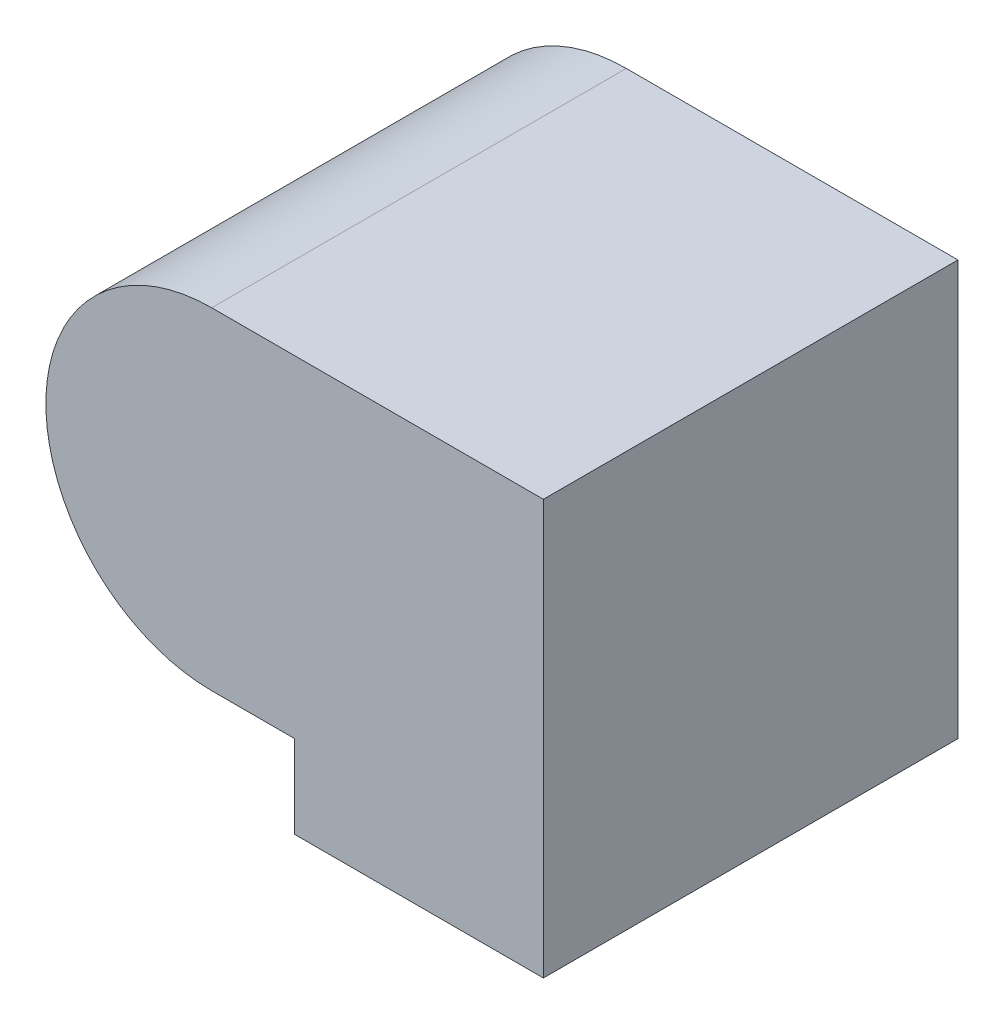
ISO-10303-21;
HEADER;
FILE_DESCRIPTION(('STEP AP214'),'2;1');
FILE_NAME('part.step','',(''),(''),'','','');
FILE_SCHEMA(('AUTOMOTIVE_DESIGN { 1 0 10303 214 1 1 1 1 }'));
ENDSEC;
DATA;
#1=APPLICATION_CONTEXT('core data for automotive mechanical design processes');
#2=APPLICATION_PROTOCOL_DEFINITION('international standard','automotive_design',2000,#1);
#3=PRODUCT_CONTEXT('',#1,'mechanical');
#4=PRODUCT('Part','Part','',(#3));
#5=PRODUCT_RELATED_PRODUCT_CATEGORY('part','',(#4));
#6=PRODUCT_DEFINITION_FORMATION('','',#4);
#7=PRODUCT_DEFINITION_CONTEXT('part definition',#1,'design');
#8=PRODUCT_DEFINITION('design','',#6,#7);
#9=PRODUCT_DEFINITION_SHAPE('','',#8);
#10=(LENGTH_UNIT() NAMED_UNIT(*) SI_UNIT(.MILLI.,.METRE.));
#11=(NAMED_UNIT(*) PLANE_ANGLE_UNIT() SI_UNIT($,.RADIAN.));
#12=(NAMED_UNIT(*) SI_UNIT($,.STERADIAN.) SOLID_ANGLE_UNIT());
#13=UNCERTAINTY_MEASURE_WITH_UNIT(LENGTH_MEASURE(1.E-05),#10,'distance_accuracy_value','');
#14=(GEOMETRIC_REPRESENTATION_CONTEXT(3) GLOBAL_UNCERTAINTY_ASSIGNED_CONTEXT((#13)) GLOBAL_UNIT_ASSIGNED_CONTEXT((#10,
#11,#12)) REPRESENTATION_CONTEXT('',''));
#15=CARTESIAN_POINT('',(0.,0.,0.));
#16=DIRECTION('',(0.,0.,1.));
#17=DIRECTION('',(1.,0.,0.));
#18=AXIS2_PLACEMENT_3D('',#15,#16,#17);
#19=CARTESIAN_POINT('',(0.,0.,25.));
#20=DIRECTION('',(0.,-1.,0.));
#21=DIRECTION('',(1.,0.,0.));
#22=AXIS2_PLACEMENT_3D('',#19,#20,#21);
#23=PLANE('',#22);
#24=DIRECTION('',(-1.,0.,0.));
#25=VECTOR('',#24,1.);
#26=CARTESIAN_POINT('',(0.,0.,0.));
#27=LINE('',#26,#25);
#28=CARTESIAN_POINT('',(15.,0.,0.));
#29=VERTEX_POINT('',#28);
#30=CARTESIAN_POINT('',(-5.,0.,0.));
#31=VERTEX_POINT('',#30);
#32=EDGE_CURVE('E119',#29,#31,#27,.T.);
#33=ORIENTED_EDGE('',*,*,#32,.T.);
#34=DIRECTION('',(0.,0.,-1.));
#35=VECTOR('',#34,1.);
#36=CARTESIAN_POINT('',(-5.,0.,25.));
#37=LINE('',#36,#35);
#38=CARTESIAN_POINT('',(-5.,0.,25.));
#39=VERTEX_POINT('',#38);
#40=EDGE_CURVE('E11',#39,#31,#37,.T.);
#41=ORIENTED_EDGE('',*,*,#40,.F.);
#42=DIRECTION('',(-1.,0.,0.));
#43=VECTOR('',#42,1.);
#44=CARTESIAN_POINT('',(0.,0.,25.));
#45=LINE('',#44,#43);
#46=CARTESIAN_POINT('',(15.,0.,25.));
#47=VERTEX_POINT('',#46);
#48=EDGE_CURVE('E133',#47,#39,#45,.T.);
#49=ORIENTED_EDGE('',*,*,#48,.F.);
#50=DIRECTION('',(0.,0.,-1.));
#51=VECTOR('',#50,1.);
#52=CARTESIAN_POINT('',(15.,0.,25.));
#53=LINE('',#52,#51);
#54=EDGE_CURVE('E51',#47,#29,#53,.T.);
#55=ORIENTED_EDGE('',*,*,#54,.T.);
#56=EDGE_LOOP('',(#33,#41,#49,#55));
#57=FACE_BOUND('',#56,.T.);
#58=ADVANCED_FACE('F35',(#57),#23,.F.);
#59=CARTESIAN_POINT('',(-5.,-10.,25.));
#60=DIRECTION('',(0.,0.,-1.));
#61=DIRECTION('',(-1.,0.,0.));
#62=AXIS2_PLACEMENT_3D('',#59,#60,#61);
#63=CYLINDRICAL_SURFACE('',#62,10.);
#64=CARTESIAN_POINT('',(-5.,-10.,0.));
#65=DIRECTION('',(0.,0.,1.));
#66=DIRECTION('',(1.,0.,0.));
#67=AXIS2_PLACEMENT_3D('',#64,#65,#66);
#68=CIRCLE('',#67,10.);
#69=CARTESIAN_POINT('',(-5.,-20.,0.));
#70=VERTEX_POINT('',#69);
#71=EDGE_CURVE('E121',#31,#70,#68,.T.);
#72=ORIENTED_EDGE('',*,*,#71,.T.);
#73=DIRECTION('',(0.,0.,-1.));
#74=VECTOR('',#73,1.);
#75=CARTESIAN_POINT('',(-5.,-20.,25.));
#76=LINE('',#75,#74);
#77=CARTESIAN_POINT('',(-5.,-20.,25.));
#78=VERTEX_POINT('',#77);
#79=EDGE_CURVE('E43',#78,#70,#76,.T.);
#80=ORIENTED_EDGE('',*,*,#79,.F.);
#81=CARTESIAN_POINT('',(-5.,-10.,25.));
#82=DIRECTION('',(0.,0.,1.));
#83=DIRECTION('',(1.,0.,0.));
#84=AXIS2_PLACEMENT_3D('',#81,#82,#83);
#85=CIRCLE('',#84,10.);
#86=EDGE_CURVE('E83',#39,#78,#85,.T.);
#87=ORIENTED_EDGE('',*,*,#86,.F.);
#88=ORIENTED_EDGE('',*,*,#40,.T.);
#89=EDGE_LOOP('',(#72,#80,#87,#88));
#90=FACE_BOUND('',#89,.T.);
#91=ADVANCED_FACE('F139',(#90),#63,.T.);
#92=CARTESIAN_POINT('',(0.,-20.,25.));
#93=DIRECTION('',(0.,-1.,0.));
#94=DIRECTION('',(0.,0.,-1.));
#95=AXIS2_PLACEMENT_3D('',#92,#93,#94);
#96=PLANE('',#95);
#97=DIRECTION('',(-1.,0.,0.));
#98=VECTOR('',#97,1.);
#99=CARTESIAN_POINT('',(0.,-20.,0.));
#100=LINE('',#99,#98);
#101=CARTESIAN_POINT('',(0.,-20.,0.));
#102=VERTEX_POINT('',#101);
#103=EDGE_CURVE('E124',#102,#70,#100,.T.);
#104=ORIENTED_EDGE('',*,*,#103,.F.);
#105=DIRECTION('',(0.,0.,-1.));
#106=VECTOR('',#105,1.);
#107=CARTESIAN_POINT('',(0.,-20.,25.));
#108=LINE('',#107,#106);
#109=CARTESIAN_POINT('',(0.,-20.,25.));
#110=VERTEX_POINT('',#109);
#111=EDGE_CURVE('E102',#110,#102,#108,.T.);
#112=ORIENTED_EDGE('',*,*,#111,.F.);
#113=DIRECTION('',(-1.,0.,0.));
#114=VECTOR('',#113,1.);
#115=CARTESIAN_POINT('',(0.,-20.,25.));
#116=LINE('',#115,#114);
#117=EDGE_CURVE('E111',#110,#78,#116,.T.);
#118=ORIENTED_EDGE('',*,*,#117,.T.);
#119=ORIENTED_EDGE('',*,*,#79,.T.);
#120=EDGE_LOOP('',(#104,#112,#118,#119));
#121=FACE_BOUND('',#120,.T.);
#122=ADVANCED_FACE('F138',(#121),#96,.T.);
#123=CARTESIAN_POINT('',(0.,0.,25.));
#124=DIRECTION('',(-1.,0.,0.));
#125=DIRECTION('',(0.,0.,1.));
#126=AXIS2_PLACEMENT_3D('',#123,#124,#125);
#127=PLANE('',#126);
#128=DIRECTION('',(0.,1.,0.));
#129=VECTOR('',#128,1.);
#130=CARTESIAN_POINT('',(0.,0.,0.));
#131=LINE('',#130,#129);
#132=CARTESIAN_POINT('',(0.,-25.,0.));
#133=VERTEX_POINT('',#132);
#134=EDGE_CURVE('E98',#133,#102,#131,.T.);
#135=ORIENTED_EDGE('',*,*,#134,.F.);
#136=DIRECTION('',(0.,0.,-1.));
#137=VECTOR('',#136,1.);
#138=CARTESIAN_POINT('',(0.,-25.,25.));
#139=LINE('',#138,#137);
#140=CARTESIAN_POINT('',(0.,-25.,25.));
#141=VERTEX_POINT('',#140);
#142=EDGE_CURVE('E93',#141,#133,#139,.T.);
#143=ORIENTED_EDGE('',*,*,#142,.F.);
#144=DIRECTION('',(0.,1.,0.));
#145=VECTOR('',#144,1.);
#146=CARTESIAN_POINT('',(0.,0.,25.));
#147=LINE('',#146,#145);
#148=EDGE_CURVE('E96',#141,#110,#147,.T.);
#149=ORIENTED_EDGE('',*,*,#148,.T.);
#150=ORIENTED_EDGE('',*,*,#111,.T.);
#151=EDGE_LOOP('',(#135,#143,#149,#150));
#152=FACE_BOUND('',#151,.T.);
#153=ADVANCED_FACE('F95',(#152),#127,.T.);
#154=CARTESIAN_POINT('',(0.,-25.,25.));
#155=DIRECTION('',(0.,-1.,0.));
#156=DIRECTION('',(1.,0.,0.));
#157=AXIS2_PLACEMENT_3D('',#154,#155,#156);
#158=PLANE('',#157);
#159=DIRECTION('',(-1.,0.,0.));
#160=VECTOR('',#159,1.);
#161=CARTESIAN_POINT('',(0.,-25.,0.));
#162=LINE('',#161,#160);
#163=CARTESIAN_POINT('',(15.,-25.,0.));
#164=VERTEX_POINT('',#163);
#165=EDGE_CURVE('E128',#164,#133,#162,.T.);
#166=ORIENTED_EDGE('',*,*,#165,.F.);
#167=DIRECTION('',(0.,0.,-1.));
#168=VECTOR('',#167,1.);
#169=CARTESIAN_POINT('',(15.,-25.,25.));
#170=LINE('',#169,#168);
#171=CARTESIAN_POINT('',(15.,-25.,25.));
#172=VERTEX_POINT('',#171);
#173=EDGE_CURVE('E71',#172,#164,#170,.T.);
#174=ORIENTED_EDGE('',*,*,#173,.F.);
#175=DIRECTION('',(-1.,0.,0.));
#176=VECTOR('',#175,1.);
#177=CARTESIAN_POINT('',(0.,-25.,25.));
#178=LINE('',#177,#176);
#179=EDGE_CURVE('E109',#172,#141,#178,.T.);
#180=ORIENTED_EDGE('',*,*,#179,.T.);
#181=ORIENTED_EDGE('',*,*,#142,.T.);
#182=EDGE_LOOP('',(#166,#174,#180,#181));
#183=FACE_BOUND('',#182,.T.);
#184=ADVANCED_FACE('F113',(#183),#158,.T.);
#185=CARTESIAN_POINT('',(15.,0.,25.));
#186=DIRECTION('',(1.,0.,0.));
#187=DIRECTION('',(0.,1.,0.));
#188=AXIS2_PLACEMENT_3D('',#185,#186,#187);
#189=PLANE('',#188);
#190=DIRECTION('',(0.,-1.,0.));
#191=VECTOR('',#190,1.);
#192=CARTESIAN_POINT('',(15.,0.,0.));
#193=LINE('',#192,#191);
#194=EDGE_CURVE('E130',#29,#164,#193,.T.);
#195=ORIENTED_EDGE('',*,*,#194,.F.);
#196=ORIENTED_EDGE('',*,*,#54,.F.);
#197=DIRECTION('',(0.,-1.,0.));
#198=VECTOR('',#197,1.);
#199=CARTESIAN_POINT('',(15.,0.,25.));
#200=LINE('',#199,#198);
#201=EDGE_CURVE('E114',#47,#172,#200,.T.);
#202=ORIENTED_EDGE('',*,*,#201,.T.);
#203=ORIENTED_EDGE('',*,*,#173,.T.);
#204=EDGE_LOOP('',(#195,#196,#202,#203));
#205=FACE_BOUND('',#204,.T.);
#206=ADVANCED_FACE('F143',(#205),#189,.T.);
#207=CARTESIAN_POINT('',(0.,0.,25.));
#208=DIRECTION('',(0.,0.,1.));
#209=DIRECTION('',(1.,0.,0.));
#210=AXIS2_PLACEMENT_3D('',#207,#208,#209);
#211=PLANE('',#210);
#212=ORIENTED_EDGE('',*,*,#48,.T.);
#213=ORIENTED_EDGE('',*,*,#86,.T.);
#214=ORIENTED_EDGE('',*,*,#117,.F.);
#215=ORIENTED_EDGE('',*,*,#148,.F.);
#216=ORIENTED_EDGE('',*,*,#179,.F.);
#217=ORIENTED_EDGE('',*,*,#201,.F.);
#218=EDGE_LOOP('',(#212,#213,#214,#215,#216,#217));
#219=FACE_BOUND('',#218,.T.);
#220=ADVANCED_FACE('F107',(#219),#211,.T.);
#221=CARTESIAN_POINT('',(0.,0.,0.));
#222=DIRECTION('',(0.,0.,1.));
#223=DIRECTION('',(1.,0.,0.));
#224=AXIS2_PLACEMENT_3D('',#221,#222,#223);
#225=PLANE('',#224);
#226=ORIENTED_EDGE('',*,*,#32,.F.);
#227=ORIENTED_EDGE('',*,*,#194,.T.);
#228=ORIENTED_EDGE('',*,*,#165,.T.);
#229=ORIENTED_EDGE('',*,*,#134,.T.);
#230=ORIENTED_EDGE('',*,*,#103,.T.);
#231=ORIENTED_EDGE('',*,*,#71,.F.);
#232=EDGE_LOOP('',(#226,#227,#228,#229,#230,#231));
#233=FACE_BOUND('',#232,.T.);
#234=ADVANCED_FACE('F142',(#233),#225,.F.);
#235=CLOSED_SHELL('',(#58,#91,#122,#153,#184,#206,#220,#234));
#236=MANIFOLD_SOLID_BREP('B2',#235);
#237=ADVANCED_BREP_SHAPE_REPRESENTATION('',(#18,#236),#14);
#238=SHAPE_DEFINITION_REPRESENTATION(#9,#237);
ENDSEC;
END-ISO-10303-21;
